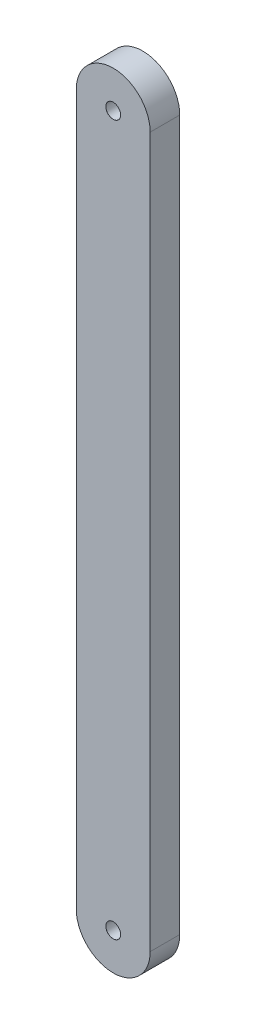
ISO-10303-21;
HEADER;
FILE_DESCRIPTION(('STEP AP214'),'2;1');
FILE_NAME('part.step','',(''),(''),'','','');
FILE_SCHEMA(('AUTOMOTIVE_DESIGN { 1 0 10303 214 1 1 1 1 }'));
ENDSEC;
DATA;
#1=APPLICATION_CONTEXT('core data for automotive mechanical design processes');
#2=APPLICATION_PROTOCOL_DEFINITION('international standard','automotive_design',2000,#1);
#3=PRODUCT_CONTEXT('',#1,'mechanical');
#4=PRODUCT('Part','Part','',(#3));
#5=PRODUCT_RELATED_PRODUCT_CATEGORY('part','',(#4));
#6=PRODUCT_DEFINITION_FORMATION('','',#4);
#7=PRODUCT_DEFINITION_CONTEXT('part definition',#1,'design');
#8=PRODUCT_DEFINITION('design','',#6,#7);
#9=PRODUCT_DEFINITION_SHAPE('','',#8);
#10=(LENGTH_UNIT() NAMED_UNIT(*) SI_UNIT(.MILLI.,.METRE.));
#11=(NAMED_UNIT(*) PLANE_ANGLE_UNIT() SI_UNIT($,.RADIAN.));
#12=(NAMED_UNIT(*) SI_UNIT($,.STERADIAN.) SOLID_ANGLE_UNIT());
#13=UNCERTAINTY_MEASURE_WITH_UNIT(LENGTH_MEASURE(1.E-05),#10,'distance_accuracy_value','');
#14=(GEOMETRIC_REPRESENTATION_CONTEXT(3) GLOBAL_UNCERTAINTY_ASSIGNED_CONTEXT((#13)) GLOBAL_UNIT_ASSIGNED_CONTEXT((#10,
#11,#12)) REPRESENTATION_CONTEXT('',''));
#15=CARTESIAN_POINT('',(0.,0.,0.));
#16=DIRECTION('',(0.,0.,1.));
#17=DIRECTION('',(1.,0.,0.));
#18=AXIS2_PLACEMENT_3D('',#15,#16,#17);
#19=CARTESIAN_POINT('',(-25.,-30.,11.2499996668486));
#20=DIRECTION('',(0.,0.,-1.));
#21=DIRECTION('',(-1.,0.,0.));
#22=AXIS2_PLACEMENT_3D('',#19,#20,#21);
#23=CYLINDRICAL_SURFACE('',#22,3.125);
#24=CARTESIAN_POINT('',(-25.,-30.,8.74999966684864));
#25=DIRECTION('',(0.,0.,1.));
#26=DIRECTION('',(-1.,0.,0.));
#27=AXIS2_PLACEMENT_3D('',#24,#25,#26);
#28=CIRCLE('',#27,3.125);
#29=CARTESIAN_POINT('',(-28.125,-30.,8.74999966684864));
#30=VERTEX_POINT('',#29);
#31=CARTESIAN_POINT('',(-21.875,-30.,8.74999966684864));
#32=VERTEX_POINT('',#31);
#33=EDGE_CURVE('E99',#30,#32,#28,.T.);
#34=ORIENTED_EDGE('',*,*,#33,.T.);
#35=DIRECTION('',(0.,0.,-1.));
#36=VECTOR('',#35,1.);
#37=CARTESIAN_POINT('',(-21.875,-30.,11.2499996668486));
#38=LINE('',#37,#36);
#39=CARTESIAN_POINT('',(-21.875,-30.,11.2499996668486));
#40=VERTEX_POINT('',#39);
#41=EDGE_CURVE('E11',#40,#32,#38,.T.);
#42=ORIENTED_EDGE('',*,*,#41,.F.);
#43=CARTESIAN_POINT('',(-25.,-30.,11.2499996668486));
#44=DIRECTION('',(0.,0.,1.));
#45=DIRECTION('',(-1.,0.,0.));
#46=AXIS2_PLACEMENT_3D('',#43,#44,#45);
#47=CIRCLE('',#46,3.125);
#48=CARTESIAN_POINT('',(-28.125,-30.,11.2499996668486));
#49=VERTEX_POINT('',#48);
#50=EDGE_CURVE('E87',#49,#40,#47,.T.);
#51=ORIENTED_EDGE('',*,*,#50,.F.);
#52=DIRECTION('',(0.,0.,-1.));
#53=VECTOR('',#52,1.);
#54=CARTESIAN_POINT('',(-28.125,-30.,11.2499996668486));
#55=LINE('',#54,#53);
#56=EDGE_CURVE('E95',#49,#30,#55,.T.);
#57=ORIENTED_EDGE('',*,*,#56,.T.);
#58=EDGE_LOOP('',(#34,#42,#51,#57));
#59=FACE_BOUND('',#58,.T.);
#60=ADVANCED_FACE('F36',(#59),#23,.T.);
#61=CARTESIAN_POINT('',(-21.875,30.,11.2499996668486));
#62=DIRECTION('',(-1.,0.,0.));
#63=DIRECTION('',(0.,-1.,0.));
#64=AXIS2_PLACEMENT_3D('',#61,#62,#63);
#65=PLANE('',#64);
#66=DIRECTION('',(0.,1.,0.));
#67=VECTOR('',#66,1.);
#68=CARTESIAN_POINT('',(-21.875,30.,8.74999966684864));
#69=LINE('',#68,#67);
#70=CARTESIAN_POINT('',(-21.875,30.,8.74999966684864));
#71=VERTEX_POINT('',#70);
#72=EDGE_CURVE('E91',#32,#71,#69,.T.);
#73=ORIENTED_EDGE('',*,*,#72,.T.);
#74=DIRECTION('',(0.,0.,-1.));
#75=VECTOR('',#74,1.);
#76=CARTESIAN_POINT('',(-21.875,30.,11.2499996668486));
#77=LINE('',#76,#75);
#78=CARTESIAN_POINT('',(-21.875,30.,11.2499996668486));
#79=VERTEX_POINT('',#78);
#80=EDGE_CURVE('E44',#79,#71,#77,.T.);
#81=ORIENTED_EDGE('',*,*,#80,.F.);
#82=DIRECTION('',(0.,1.,0.));
#83=VECTOR('',#82,1.);
#84=CARTESIAN_POINT('',(-21.875,30.,11.2499996668486));
#85=LINE('',#84,#83);
#86=EDGE_CURVE('E82',#40,#79,#85,.T.);
#87=ORIENTED_EDGE('',*,*,#86,.F.);
#88=ORIENTED_EDGE('',*,*,#41,.T.);
#89=EDGE_LOOP('',(#73,#81,#87,#88));
#90=FACE_BOUND('',#89,.T.);
#91=ADVANCED_FACE('F90',(#90),#65,.F.);
#92=CARTESIAN_POINT('',(-25.,30.,11.2499996668486));
#93=DIRECTION('',(0.,0.,-1.));
#94=DIRECTION('',(-1.,0.,0.));
#95=AXIS2_PLACEMENT_3D('',#92,#93,#94);
#96=CYLINDRICAL_SURFACE('',#95,3.125);
#97=CARTESIAN_POINT('',(-25.,30.,8.74999966684864));
#98=DIRECTION('',(0.,0.,1.));
#99=DIRECTION('',(-1.,0.,0.));
#100=AXIS2_PLACEMENT_3D('',#97,#98,#99);
#101=CIRCLE('',#100,3.125);
#102=CARTESIAN_POINT('',(-28.125,30.,8.74999966684864));
#103=VERTEX_POINT('',#102);
#104=EDGE_CURVE('E69',#71,#103,#101,.T.);
#105=ORIENTED_EDGE('',*,*,#104,.T.);
#106=DIRECTION('',(0.,0.,-1.));
#107=VECTOR('',#106,1.);
#108=CARTESIAN_POINT('',(-28.125,30.,11.2499996668486));
#109=LINE('',#108,#107);
#110=CARTESIAN_POINT('',(-28.125,30.,11.2499996668486));
#111=VERTEX_POINT('',#110);
#112=EDGE_CURVE('E92',#111,#103,#109,.T.);
#113=ORIENTED_EDGE('',*,*,#112,.F.);
#114=CARTESIAN_POINT('',(-25.,30.,11.2499996668486));
#115=DIRECTION('',(0.,0.,1.));
#116=DIRECTION('',(-1.,0.,0.));
#117=AXIS2_PLACEMENT_3D('',#114,#115,#116);
#118=CIRCLE('',#117,3.125);
#119=EDGE_CURVE('E85',#79,#111,#118,.T.);
#120=ORIENTED_EDGE('',*,*,#119,.F.);
#121=ORIENTED_EDGE('',*,*,#80,.T.);
#122=EDGE_LOOP('',(#105,#113,#120,#121));
#123=FACE_BOUND('',#122,.T.);
#124=ADVANCED_FACE('F93',(#123),#96,.T.);
#125=CARTESIAN_POINT('',(-28.125,-30.,11.2499996668486));
#126=DIRECTION('',(1.,0.,0.));
#127=DIRECTION('',(0.,0.,-1.));
#128=AXIS2_PLACEMENT_3D('',#125,#126,#127);
#129=PLANE('',#128);
#130=DIRECTION('',(0.,-1.,0.));
#131=VECTOR('',#130,1.);
#132=CARTESIAN_POINT('',(-28.125,-30.,8.74999966684864));
#133=LINE('',#132,#131);
#134=EDGE_CURVE('E75',#103,#30,#133,.T.);
#135=ORIENTED_EDGE('',*,*,#134,.T.);
#136=ORIENTED_EDGE('',*,*,#56,.F.);
#137=DIRECTION('',(0.,-1.,0.));
#138=VECTOR('',#137,1.);
#139=CARTESIAN_POINT('',(-28.125,-30.,11.2499996668486));
#140=LINE('',#139,#138);
#141=EDGE_CURVE('E52',#111,#49,#140,.T.);
#142=ORIENTED_EDGE('',*,*,#141,.F.);
#143=ORIENTED_EDGE('',*,*,#112,.T.);
#144=EDGE_LOOP('',(#135,#136,#142,#143));
#145=FACE_BOUND('',#144,.T.);
#146=ADVANCED_FACE('F107',(#145),#129,.F.);
#147=CARTESIAN_POINT('',(-25.,-30.,11.2499996668486));
#148=DIRECTION('',(0.,0.,-1.));
#149=DIRECTION('',(-1.,0.,0.));
#150=AXIS2_PLACEMENT_3D('',#147,#148,#149);
#151=PLANE('',#150);
#152=CARTESIAN_POINT('',(-25.,30.,11.2499996668486));
#153=DIRECTION('',(0.,0.,1.));
#154=DIRECTION('',(1.,0.,0.));
#155=AXIS2_PLACEMENT_3D('',#152,#153,#154);
#156=CIRCLE('',#155,0.628125);
#157=CARTESIAN_POINT('',(-24.371875,30.,11.2499996668486));
#158=VERTEX_POINT('',#157);
#159=EDGE_CURVE('E127',#158,#158,#156,.T.);
#160=ORIENTED_EDGE('',*,*,#159,.F.);
#161=EDGE_LOOP('',(#160));
#162=FACE_BOUND('',#161,.T.);
#163=CARTESIAN_POINT('',(-25.,-30.,11.2499996668486));
#164=DIRECTION('',(0.,0.,1.));
#165=DIRECTION('',(1.,0.,0.));
#166=AXIS2_PLACEMENT_3D('',#163,#164,#165);
#167=CIRCLE('',#166,0.628125);
#168=CARTESIAN_POINT('',(-24.371875,-30.,11.2499996668486));
#169=VERTEX_POINT('',#168);
#170=EDGE_CURVE('E118',#169,#169,#167,.T.);
#171=ORIENTED_EDGE('',*,*,#170,.F.);
#172=EDGE_LOOP('',(#171));
#173=FACE_BOUND('',#172,.T.);
#174=ORIENTED_EDGE('',*,*,#50,.T.);
#175=ORIENTED_EDGE('',*,*,#86,.T.);
#176=ORIENTED_EDGE('',*,*,#119,.T.);
#177=ORIENTED_EDGE('',*,*,#141,.T.);
#178=EDGE_LOOP('',(#174,#175,#176,#177));
#179=FACE_BOUND('',#178,.T.);
#180=ADVANCED_FACE('F83',(#162,#173,#179),#151,.F.);
#181=CARTESIAN_POINT('',(-25.,-30.,8.74999966684864));
#182=DIRECTION('',(0.,0.,-1.));
#183=DIRECTION('',(-1.,0.,0.));
#184=AXIS2_PLACEMENT_3D('',#181,#182,#183);
#185=PLANE('',#184);
#186=CARTESIAN_POINT('',(-25.,30.,8.74999966684864));
#187=DIRECTION('',(0.,0.,1.));
#188=DIRECTION('',(1.,0.,0.));
#189=AXIS2_PLACEMENT_3D('',#186,#187,#188);
#190=CIRCLE('',#189,0.625);
#191=CARTESIAN_POINT('',(-24.375,30.,8.74999966684864));
#192=VERTEX_POINT('',#191);
#193=EDGE_CURVE('E121',#192,#192,#190,.T.);
#194=ORIENTED_EDGE('',*,*,#193,.T.);
#195=EDGE_LOOP('',(#194));
#196=FACE_BOUND('',#195,.T.);
#197=CARTESIAN_POINT('',(-25.,-30.,8.74999966684864));
#198=DIRECTION('',(0.,0.,1.));
#199=DIRECTION('',(1.,0.,0.));
#200=AXIS2_PLACEMENT_3D('',#197,#198,#199);
#201=CIRCLE('',#200,0.625);
#202=CARTESIAN_POINT('',(-24.375,-30.,8.74999966684864));
#203=VERTEX_POINT('',#202);
#204=EDGE_CURVE('E102',#203,#203,#201,.T.);
#205=ORIENTED_EDGE('',*,*,#204,.T.);
#206=EDGE_LOOP('',(#205));
#207=FACE_BOUND('',#206,.T.);
#208=ORIENTED_EDGE('',*,*,#33,.F.);
#209=ORIENTED_EDGE('',*,*,#134,.F.);
#210=ORIENTED_EDGE('',*,*,#104,.F.);
#211=ORIENTED_EDGE('',*,*,#72,.F.);
#212=EDGE_LOOP('',(#208,#209,#210,#211));
#213=FACE_BOUND('',#212,.T.);
#214=ADVANCED_FACE('F110',(#196,#207,#213),#185,.T.);
#215=CARTESIAN_POINT('',(-25.,-30.,11.2499996668486));
#216=DIRECTION('',(0.,0.,1.));
#217=DIRECTION('',(1.,0.,0.));
#218=AXIS2_PLACEMENT_3D('',#215,#216,#217);
#219=CYLINDRICAL_SURFACE('',#218,0.625);
#220=ORIENTED_EDGE('',*,*,#204,.F.);
#221=EDGE_LOOP('',(#220));
#222=FACE_BOUND('',#221,.T.);
#223=CARTESIAN_POINT('',(-25.,-30.,11.2468746668486));
#224=DIRECTION('',(0.,0.,1.));
#225=DIRECTION('',(1.,0.,0.));
#226=AXIS2_PLACEMENT_3D('',#223,#224,#225);
#227=CIRCLE('',#226,0.625);
#228=CARTESIAN_POINT('',(-24.375,-30.,11.2468746668486));
#229=VERTEX_POINT('',#228);
#230=EDGE_CURVE('E115',#229,#229,#227,.T.);
#231=ORIENTED_EDGE('',*,*,#230,.T.);
#232=EDGE_LOOP('',(#231));
#233=FACE_BOUND('',#232,.T.);
#234=ADVANCED_FACE('F141',(#222,#233),#219,.F.);
#235=CARTESIAN_POINT('',(-25.,-30.,11.2499996668486));
#236=DIRECTION('',(0.,0.,1.));
#237=DIRECTION('',(1.,0.,0.));
#238=AXIS2_PLACEMENT_3D('',#235,#236,#237);
#239=CONICAL_SURFACE('',#238,0.628125,0.785398163397587);
#240=ORIENTED_EDGE('',*,*,#230,.F.);
#241=EDGE_LOOP('',(#240));
#242=FACE_BOUND('',#241,.T.);
#243=ORIENTED_EDGE('',*,*,#170,.T.);
#244=EDGE_LOOP('',(#243));
#245=FACE_BOUND('',#244,.T.);
#246=ADVANCED_FACE('F138',(#242,#245),#239,.F.);
#247=CARTESIAN_POINT('',(-25.,30.,11.2499996668486));
#248=DIRECTION('',(0.,0.,1.));
#249=DIRECTION('',(1.,0.,0.));
#250=AXIS2_PLACEMENT_3D('',#247,#248,#249);
#251=CYLINDRICAL_SURFACE('',#250,0.625);
#252=ORIENTED_EDGE('',*,*,#193,.F.);
#253=EDGE_LOOP('',(#252));
#254=FACE_BOUND('',#253,.T.);
#255=CARTESIAN_POINT('',(-25.,30.,11.2468746668486));
#256=DIRECTION('',(0.,0.,1.));
#257=DIRECTION('',(1.,0.,0.));
#258=AXIS2_PLACEMENT_3D('',#255,#256,#257);
#259=CIRCLE('',#258,0.625);
#260=CARTESIAN_POINT('',(-24.375,30.,11.2468746668486));
#261=VERTEX_POINT('',#260);
#262=EDGE_CURVE('E124',#261,#261,#259,.T.);
#263=ORIENTED_EDGE('',*,*,#262,.T.);
#264=EDGE_LOOP('',(#263));
#265=FACE_BOUND('',#264,.T.);
#266=ADVANCED_FACE('F140',(#254,#265),#251,.F.);
#267=CARTESIAN_POINT('',(-25.,30.,11.2499996668486));
#268=DIRECTION('',(0.,0.,1.));
#269=DIRECTION('',(1.,0.,0.));
#270=AXIS2_PLACEMENT_3D('',#267,#268,#269);
#271=CONICAL_SURFACE('',#270,0.628125,0.785398163397587);
#272=ORIENTED_EDGE('',*,*,#262,.F.);
#273=EDGE_LOOP('',(#272));
#274=FACE_BOUND('',#273,.T.);
#275=ORIENTED_EDGE('',*,*,#159,.T.);
#276=EDGE_LOOP('',(#275));
#277=FACE_BOUND('',#276,.T.);
#278=ADVANCED_FACE('F131',(#274,#277),#271,.F.);
#279=CLOSED_SHELL('',(#60,#91,#124,#146,#180,#214,#234,#246,#266,#278));
#280=MANIFOLD_SOLID_BREP('B2',#279);
#281=ADVANCED_BREP_SHAPE_REPRESENTATION('',(#18,#280),#14);
#282=SHAPE_DEFINITION_REPRESENTATION(#9,#281);
ENDSEC;
END-ISO-10303-21;
